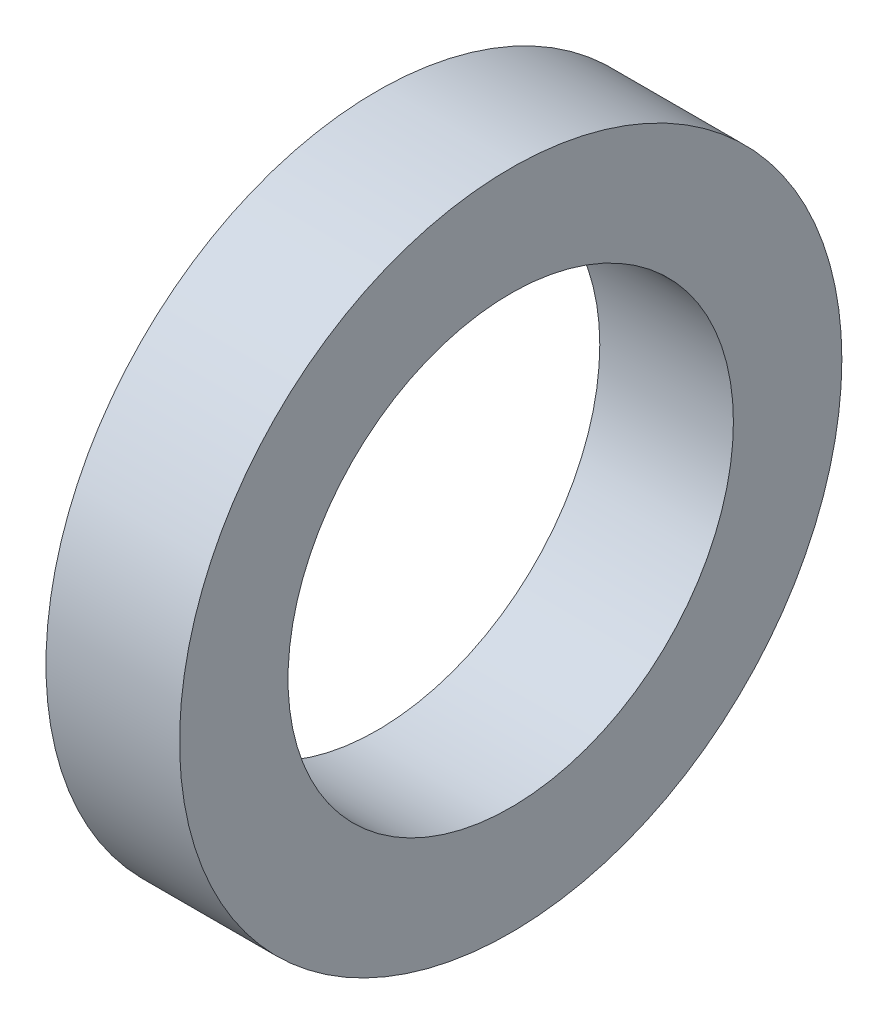
ISO-10303-21;
HEADER;
FILE_DESCRIPTION(('STEP AP214'),'2;1');
FILE_NAME('part.step','',(''),(''),'','','');
FILE_SCHEMA(('AUTOMOTIVE_DESIGN { 1 0 10303 214 1 1 1 1 }'));
ENDSEC;
DATA;
#1=APPLICATION_CONTEXT('core data for automotive mechanical design processes');
#2=APPLICATION_PROTOCOL_DEFINITION('international standard','automotive_design',2000,#1);
#3=PRODUCT_CONTEXT('',#1,'mechanical');
#4=PRODUCT('Part','Part','',(#3));
#5=PRODUCT_RELATED_PRODUCT_CATEGORY('part','',(#4));
#6=PRODUCT_DEFINITION_FORMATION('','',#4);
#7=PRODUCT_DEFINITION_CONTEXT('part definition',#1,'design');
#8=PRODUCT_DEFINITION('design','',#6,#7);
#9=PRODUCT_DEFINITION_SHAPE('','',#8);
#10=(LENGTH_UNIT() NAMED_UNIT(*) SI_UNIT(.MILLI.,.METRE.));
#11=(NAMED_UNIT(*) PLANE_ANGLE_UNIT() SI_UNIT($,.RADIAN.));
#12=(NAMED_UNIT(*) SI_UNIT($,.STERADIAN.) SOLID_ANGLE_UNIT());
#13=UNCERTAINTY_MEASURE_WITH_UNIT(LENGTH_MEASURE(1.E-05),#10,'distance_accuracy_value','');
#14=(GEOMETRIC_REPRESENTATION_CONTEXT(3) GLOBAL_UNCERTAINTY_ASSIGNED_CONTEXT((#13)) GLOBAL_UNIT_ASSIGNED_CONTEXT((#10,
#11,#12)) REPRESENTATION_CONTEXT('',''));
#15=CARTESIAN_POINT('',(0.,0.,0.));
#16=DIRECTION('',(0.,0.,1.));
#17=DIRECTION('',(1.,0.,0.));
#18=AXIS2_PLACEMENT_3D('',#15,#16,#17);
#19=CARTESIAN_POINT('',(9.525,0.,0.));
#20=DIRECTION('',(1.,0.,0.));
#21=DIRECTION('',(0.,0.,-1.));
#22=AXIS2_PLACEMENT_3D('',#19,#20,#21);
#23=PLANE('',#22);
#24=CARTESIAN_POINT('',(9.525,0.,0.));
#25=DIRECTION('',(1.,0.,0.));
#26=DIRECTION('',(0.,0.,-1.));
#27=AXIS2_PLACEMENT_3D('',#24,#25,#26);
#28=CIRCLE('',#27,47.21225);
#29=CARTESIAN_POINT('',(9.525,0.,-47.21225));
#30=VERTEX_POINT('',#29);
#31=EDGE_CURVE('E10',#30,#30,#28,.T.);
#32=ORIENTED_EDGE('',*,*,#31,.T.);
#33=EDGE_LOOP('',(#32));
#34=FACE_BOUND('',#33,.T.);
#35=CARTESIAN_POINT('',(9.525,0.,0.));
#36=DIRECTION('',(1.,0.,0.));
#37=DIRECTION('',(0.,0.,-1.));
#38=AXIS2_PLACEMENT_3D('',#35,#36,#37);
#39=CIRCLE('',#38,31.75);
#40=CARTESIAN_POINT('',(9.525,0.,-31.75));
#41=VERTEX_POINT('',#40);
#42=EDGE_CURVE('E54',#41,#41,#39,.T.);
#43=ORIENTED_EDGE('',*,*,#42,.F.);
#44=EDGE_LOOP('',(#43));
#45=FACE_BOUND('',#44,.T.);
#46=ADVANCED_FACE('F39',(#34,#45),#23,.T.);
#47=CARTESIAN_POINT('',(-9.525,0.,0.));
#48=DIRECTION('',(1.,0.,0.));
#49=DIRECTION('',(0.,0.,-1.));
#50=AXIS2_PLACEMENT_3D('',#47,#48,#49);
#51=PLANE('',#50);
#52=CARTESIAN_POINT('',(-9.525,0.,0.));
#53=DIRECTION('',(1.,0.,0.));
#54=DIRECTION('',(0.,0.,-1.));
#55=AXIS2_PLACEMENT_3D('',#52,#53,#54);
#56=CIRCLE('',#55,47.21225);
#57=CARTESIAN_POINT('',(-9.525,0.,-47.21225));
#58=VERTEX_POINT('',#57);
#59=EDGE_CURVE('E43',#58,#58,#56,.T.);
#60=ORIENTED_EDGE('',*,*,#59,.F.);
#61=EDGE_LOOP('',(#60));
#62=FACE_BOUND('',#61,.T.);
#63=CARTESIAN_POINT('',(-9.525,0.,0.));
#64=DIRECTION('',(1.,0.,0.));
#65=DIRECTION('',(0.,0.,-1.));
#66=AXIS2_PLACEMENT_3D('',#63,#64,#65);
#67=CIRCLE('',#66,31.75);
#68=CARTESIAN_POINT('',(-9.525,0.,-31.75));
#69=VERTEX_POINT('',#68);
#70=EDGE_CURVE('E56',#69,#69,#67,.T.);
#71=ORIENTED_EDGE('',*,*,#70,.T.);
#72=EDGE_LOOP('',(#71));
#73=FACE_BOUND('',#72,.T.);
#74=ADVANCED_FACE('F66',(#62,#73),#51,.F.);
#75=CARTESIAN_POINT('',(9.525,0.,0.));
#76=DIRECTION('',(-1.,0.,0.));
#77=DIRECTION('',(0.,0.,1.));
#78=AXIS2_PLACEMENT_3D('',#75,#76,#77);
#79=CYLINDRICAL_SURFACE('',#78,47.21225);
#80=ORIENTED_EDGE('',*,*,#31,.F.);
#81=EDGE_LOOP('',(#80));
#82=FACE_BOUND('',#81,.T.);
#83=ORIENTED_EDGE('',*,*,#59,.T.);
#84=EDGE_LOOP('',(#83));
#85=FACE_BOUND('',#84,.T.);
#86=ADVANCED_FACE('F41',(#82,#85),#79,.T.);
#87=CARTESIAN_POINT('',(9.525,0.,0.));
#88=DIRECTION('',(-1.,0.,0.));
#89=DIRECTION('',(0.,0.,1.));
#90=AXIS2_PLACEMENT_3D('',#87,#88,#89);
#91=CYLINDRICAL_SURFACE('',#90,31.75);
#92=ORIENTED_EDGE('',*,*,#42,.T.);
#93=EDGE_LOOP('',(#92));
#94=FACE_BOUND('',#93,.T.);
#95=ORIENTED_EDGE('',*,*,#70,.F.);
#96=EDGE_LOOP('',(#95));
#97=FACE_BOUND('',#96,.T.);
#98=ADVANCED_FACE('F62',(#94,#97),#91,.F.);
#99=CLOSED_SHELL('',(#46,#74,#86,#98));
#100=MANIFOLD_SOLID_BREP('B2',#99);
#101=ADVANCED_BREP_SHAPE_REPRESENTATION('',(#18,#100),#14);
#102=SHAPE_DEFINITION_REPRESENTATION(#9,#101);
ENDSEC;
END-ISO-10303-21;
